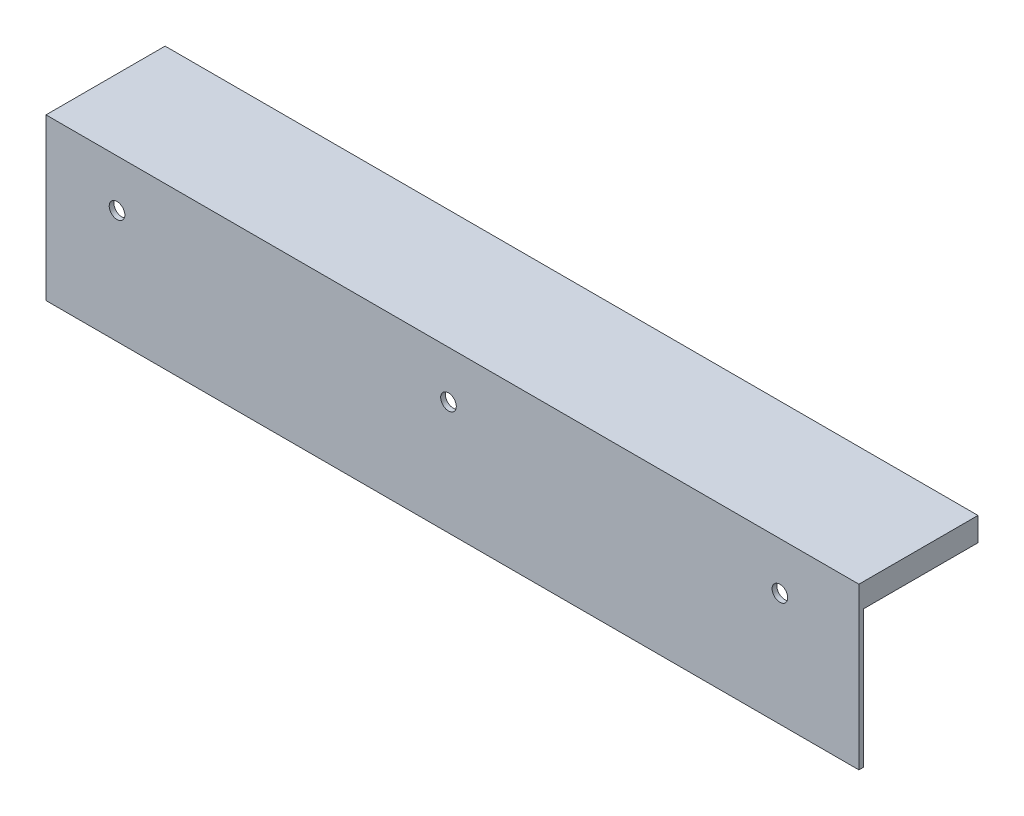
ISO-10303-21;
HEADER;
FILE_DESCRIPTION(('STEP AP214'),'2;1');
FILE_NAME('part.step','',(''),(''),'','','');
FILE_SCHEMA(('AUTOMOTIVE_DESIGN { 1 0 10303 214 1 1 1 1 }'));
ENDSEC;
DATA;
#1=APPLICATION_CONTEXT('core data for automotive mechanical design processes');
#2=APPLICATION_PROTOCOL_DEFINITION('international standard','automotive_design',2000,#1);
#3=PRODUCT_CONTEXT('',#1,'mechanical');
#4=PRODUCT('Part','Part','',(#3));
#5=PRODUCT_RELATED_PRODUCT_CATEGORY('part','',(#4));
#6=PRODUCT_DEFINITION_FORMATION('','',#4);
#7=PRODUCT_DEFINITION_CONTEXT('part definition',#1,'design');
#8=PRODUCT_DEFINITION('design','',#6,#7);
#9=PRODUCT_DEFINITION_SHAPE('','',#8);
#10=(LENGTH_UNIT() NAMED_UNIT(*) SI_UNIT(.MILLI.,.METRE.));
#11=(NAMED_UNIT(*) PLANE_ANGLE_UNIT() SI_UNIT($,.RADIAN.));
#12=(NAMED_UNIT(*) SI_UNIT($,.STERADIAN.) SOLID_ANGLE_UNIT());
#13=UNCERTAINTY_MEASURE_WITH_UNIT(LENGTH_MEASURE(1.E-05),#10,'distance_accuracy_value','');
#14=(GEOMETRIC_REPRESENTATION_CONTEXT(3) GLOBAL_UNCERTAINTY_ASSIGNED_CONTEXT((#13)) GLOBAL_UNIT_ASSIGNED_CONTEXT((#10,
#11,#12)) REPRESENTATION_CONTEXT('',''));
#15=CARTESIAN_POINT('',(0.,0.,0.));
#16=DIRECTION('',(0.,0.,1.));
#17=DIRECTION('',(1.,0.,0.));
#18=AXIS2_PLACEMENT_3D('',#15,#16,#17);
#19=CARTESIAN_POINT('',(0.,0.,1.));
#20=DIRECTION('',(0.,0.,1.));
#21=DIRECTION('',(1.,0.,0.));
#22=AXIS2_PLACEMENT_3D('',#19,#20,#21);
#23=PLANE('',#22);
#24=CARTESIAN_POINT('',(-138.1002778115,267.5,1.));
#25=DIRECTION('',(0.,0.,1.));
#26=DIRECTION('',(1.,0.,0.));
#27=AXIS2_PLACEMENT_3D('',#24,#25,#26);
#28=CIRCLE('',#27,1.65000000000002);
#29=CARTESIAN_POINT('',(-136.4502778115,267.5,1.));
#30=VERTEX_POINT('',#29);
#31=EDGE_CURVE('E137',#30,#30,#28,.T.);
#32=ORIENTED_EDGE('',*,*,#31,.F.);
#33=EDGE_LOOP('',(#32));
#34=FACE_BOUND('',#33,.T.);
#35=DIRECTION('',(0.,-1.,0.));
#36=VECTOR('',#35,1.);
#37=CARTESIAN_POINT('',(-223.1002778115,272.5,1.));
#38=LINE('',#37,#36);
#39=CARTESIAN_POINT('',(-223.1002778115,277.5,1.));
#40=VERTEX_POINT('',#39);
#41=CARTESIAN_POINT('',(-223.1002778115,243.530571674649,1.));
#42=VERTEX_POINT('',#41);
#43=EDGE_CURVE('E103',#40,#42,#38,.T.);
#44=ORIENTED_EDGE('',*,*,#43,.T.);
#45=DIRECTION('',(1.,0.,0.));
#46=VECTOR('',#45,1.);
#47=CARTESIAN_POINT('',(-223.1002778115,243.530571674649,1.));
#48=LINE('',#47,#46);
#49=CARTESIAN_POINT('',(-51.419079965,243.530571674649,1.));
#50=VERTEX_POINT('',#49);
#51=EDGE_CURVE('E63',#42,#50,#48,.T.);
#52=ORIENTED_EDGE('',*,*,#51,.T.);
#53=DIRECTION('',(0.,1.,0.));
#54=VECTOR('',#53,1.);
#55=CARTESIAN_POINT('',(-51.419079965,272.5,1.));
#56=LINE('',#55,#54);
#57=CARTESIAN_POINT('',(-51.419079965,277.5,1.));
#58=VERTEX_POINT('',#57);
#59=EDGE_CURVE('E156',#50,#58,#56,.T.);
#60=ORIENTED_EDGE('',*,*,#59,.T.);
#61=DIRECTION('',(1.,0.,0.));
#62=VECTOR('',#61,1.);
#63=CARTESIAN_POINT('',(-223.1002778115,277.5,1.));
#64=LINE('',#63,#62);
#65=EDGE_CURVE('E188',#40,#58,#64,.T.);
#66=ORIENTED_EDGE('',*,*,#65,.F.);
#67=EDGE_LOOP('',(#44,#52,#60,#66));
#68=FACE_BOUND('',#67,.T.);
#69=CARTESIAN_POINT('',(-208.1002778115,267.5,1.));
#70=DIRECTION('',(0.,0.,1.));
#71=DIRECTION('',(1.,0.,0.));
#72=AXIS2_PLACEMENT_3D('',#69,#70,#71);
#73=CIRCLE('',#72,1.65000000000002);
#74=CARTESIAN_POINT('',(-206.4502778115,267.5,1.));
#75=VERTEX_POINT('',#74);
#76=EDGE_CURVE('E145',#75,#75,#73,.T.);
#77=ORIENTED_EDGE('',*,*,#76,.F.);
#78=EDGE_LOOP('',(#77));
#79=FACE_BOUND('',#78,.T.);
#80=CARTESIAN_POINT('',(-68.1002778115,267.5,1.));
#81=DIRECTION('',(0.,0.,1.));
#82=DIRECTION('',(1.,0.,0.));
#83=AXIS2_PLACEMENT_3D('',#80,#81,#82);
#84=CIRCLE('',#83,1.65000000000001);
#85=CARTESIAN_POINT('',(-66.4502778115,267.5,1.));
#86=VERTEX_POINT('',#85);
#87=EDGE_CURVE('E129',#86,#86,#84,.T.);
#88=ORIENTED_EDGE('',*,*,#87,.F.);
#89=EDGE_LOOP('',(#88));
#90=FACE_BOUND('',#89,.T.);
#91=ADVANCED_FACE('F45',(#34,#68,#79,#90),#23,.T.);
#92=CARTESIAN_POINT('',(0.,0.,0.));
#93=DIRECTION('',(0.,0.,1.));
#94=DIRECTION('',(1.,0.,0.));
#95=AXIS2_PLACEMENT_3D('',#92,#93,#94);
#96=PLANE('',#95);
#97=DIRECTION('',(0.,-1.,0.));
#98=VECTOR('',#97,1.);
#99=CARTESIAN_POINT('',(-223.1002778115,272.5,0.));
#100=LINE('',#99,#98);
#101=CARTESIAN_POINT('',(-223.1002778115,272.5,0.));
#102=VERTEX_POINT('',#101);
#103=CARTESIAN_POINT('',(-223.1002778115,243.530571674649,0.));
#104=VERTEX_POINT('',#103);
#105=EDGE_CURVE('E98',#102,#104,#100,.T.);
#106=ORIENTED_EDGE('',*,*,#105,.F.);
#107=DIRECTION('',(-1.,0.,0.));
#108=VECTOR('',#107,1.);
#109=CARTESIAN_POINT('',(-223.1002778115,272.5,0.));
#110=LINE('',#109,#108);
#111=CARTESIAN_POINT('',(-51.419079965,272.5,0.));
#112=VERTEX_POINT('',#111);
#113=EDGE_CURVE('E91',#112,#102,#110,.T.);
#114=ORIENTED_EDGE('',*,*,#113,.F.);
#115=DIRECTION('',(0.,1.,0.));
#116=VECTOR('',#115,1.);
#117=CARTESIAN_POINT('',(-51.419079965,272.5,0.));
#118=LINE('',#117,#116);
#119=CARTESIAN_POINT('',(-51.419079965,243.530571674649,0.));
#120=VERTEX_POINT('',#119);
#121=EDGE_CURVE('E80',#120,#112,#118,.T.);
#122=ORIENTED_EDGE('',*,*,#121,.F.);
#123=DIRECTION('',(1.,0.,0.));
#124=VECTOR('',#123,1.);
#125=CARTESIAN_POINT('',(-223.1002778115,243.530571674649,0.));
#126=LINE('',#125,#124);
#127=EDGE_CURVE('E74',#104,#120,#126,.T.);
#128=ORIENTED_EDGE('',*,*,#127,.F.);
#129=EDGE_LOOP('',(#106,#114,#122,#128));
#130=FACE_BOUND('',#129,.T.);
#131=CARTESIAN_POINT('',(-208.1002778115,267.5,0.));
#132=DIRECTION('',(0.,0.,1.));
#133=DIRECTION('',(1.,0.,0.));
#134=AXIS2_PLACEMENT_3D('',#131,#132,#133);
#135=CIRCLE('',#134,1.65000000000002);
#136=CARTESIAN_POINT('',(-206.4502778115,267.5,0.));
#137=VERTEX_POINT('',#136);
#138=EDGE_CURVE('E141',#137,#137,#135,.T.);
#139=ORIENTED_EDGE('',*,*,#138,.T.);
#140=EDGE_LOOP('',(#139));
#141=FACE_BOUND('',#140,.T.);
#142=CARTESIAN_POINT('',(-138.1002778115,267.5,0.));
#143=DIRECTION('',(0.,0.,1.));
#144=DIRECTION('',(1.,0.,0.));
#145=AXIS2_PLACEMENT_3D('',#142,#143,#144);
#146=CIRCLE('',#145,1.65000000000002);
#147=CARTESIAN_POINT('',(-136.4502778115,267.5,0.));
#148=VERTEX_POINT('',#147);
#149=EDGE_CURVE('E133',#148,#148,#146,.T.);
#150=ORIENTED_EDGE('',*,*,#149,.T.);
#151=EDGE_LOOP('',(#150));
#152=FACE_BOUND('',#151,.T.);
#153=CARTESIAN_POINT('',(-68.1002778115,267.5,0.));
#154=DIRECTION('',(0.,0.,1.));
#155=DIRECTION('',(1.,0.,0.));
#156=AXIS2_PLACEMENT_3D('',#153,#154,#155);
#157=CIRCLE('',#156,1.65000000000001);
#158=CARTESIAN_POINT('',(-66.4502778115,267.5,0.));
#159=VERTEX_POINT('',#158);
#160=EDGE_CURVE('E128',#159,#159,#157,.T.);
#161=ORIENTED_EDGE('',*,*,#160,.T.);
#162=EDGE_LOOP('',(#161));
#163=FACE_BOUND('',#162,.T.);
#164=ADVANCED_FACE('F95',(#130,#141,#152,#163),#96,.F.);
#165=CARTESIAN_POINT('',(-223.1002778115,272.5,1.));
#166=DIRECTION('',(1.,0.,0.));
#167=DIRECTION('',(0.,0.,-1.));
#168=AXIS2_PLACEMENT_3D('',#165,#166,#167);
#169=PLANE('',#168);
#170=ORIENTED_EDGE('',*,*,#105,.T.);
#171=DIRECTION('',(0.,0.,-1.));
#172=VECTOR('',#171,1.);
#173=CARTESIAN_POINT('',(-223.1002778115,243.530571674649,1.));
#174=LINE('',#173,#172);
#175=EDGE_CURVE('E11',#42,#104,#174,.T.);
#176=ORIENTED_EDGE('',*,*,#175,.F.);
#177=ORIENTED_EDGE('',*,*,#43,.F.);
#178=DIRECTION('',(0.,0.,1.));
#179=VECTOR('',#178,1.);
#180=CARTESIAN_POINT('',(-223.1002778115,277.5,1.));
#181=LINE('',#180,#179);
#182=CARTESIAN_POINT('',(-223.1002778115,277.5,-24.1515189829471));
#183=VERTEX_POINT('',#182);
#184=EDGE_CURVE('E115',#183,#40,#181,.T.);
#185=ORIENTED_EDGE('',*,*,#184,.F.);
#186=DIRECTION('',(0.,-1.,0.));
#187=VECTOR('',#186,1.);
#188=CARTESIAN_POINT('',(-223.1002778115,277.5,-24.1515189829471));
#189=LINE('',#188,#187);
#190=CARTESIAN_POINT('',(-223.1002778115,272.5,-24.1515189829471));
#191=VERTEX_POINT('',#190);
#192=EDGE_CURVE('E120',#183,#191,#189,.T.);
#193=ORIENTED_EDGE('',*,*,#192,.T.);
#194=DIRECTION('',(0.,0.,1.));
#195=VECTOR('',#194,1.);
#196=CARTESIAN_POINT('',(-223.1002778115,272.5,1.));
#197=LINE('',#196,#195);
#198=EDGE_CURVE('E110',#191,#102,#197,.T.);
#199=ORIENTED_EDGE('',*,*,#198,.T.);
#200=EDGE_LOOP('',(#170,#176,#177,#185,#193,#199));
#201=FACE_BOUND('',#200,.T.);
#202=ADVANCED_FACE('F47',(#201),#169,.F.);
#203=CARTESIAN_POINT('',(-223.1002778115,243.530571674649,1.));
#204=DIRECTION('',(0.,1.,0.));
#205=DIRECTION('',(0.,0.,1.));
#206=AXIS2_PLACEMENT_3D('',#203,#204,#205);
#207=PLANE('',#206);
#208=ORIENTED_EDGE('',*,*,#127,.T.);
#209=DIRECTION('',(0.,0.,-1.));
#210=VECTOR('',#209,1.);
#211=CARTESIAN_POINT('',(-51.419079965,243.530571674649,1.));
#212=LINE('',#211,#210);
#213=EDGE_CURVE('E55',#50,#120,#212,.T.);
#214=ORIENTED_EDGE('',*,*,#213,.F.);
#215=ORIENTED_EDGE('',*,*,#51,.F.);
#216=ORIENTED_EDGE('',*,*,#175,.T.);
#217=EDGE_LOOP('',(#208,#214,#215,#216));
#218=FACE_BOUND('',#217,.T.);
#219=ADVANCED_FACE('F222',(#218),#207,.F.);
#220=CARTESIAN_POINT('',(-51.419079965,272.5,1.));
#221=DIRECTION('',(-1.,0.,0.));
#222=DIRECTION('',(0.,-1.,0.));
#223=AXIS2_PLACEMENT_3D('',#220,#221,#222);
#224=PLANE('',#223);
#225=ORIENTED_EDGE('',*,*,#121,.T.);
#226=DIRECTION('',(0.,0.,-1.));
#227=VECTOR('',#226,1.);
#228=CARTESIAN_POINT('',(-51.419079965,272.5,1.));
#229=LINE('',#228,#227);
#230=CARTESIAN_POINT('',(-51.419079965,272.5,-24.1515189829471));
#231=VERTEX_POINT('',#230);
#232=EDGE_CURVE('E86',#112,#231,#229,.T.);
#233=ORIENTED_EDGE('',*,*,#232,.T.);
#234=DIRECTION('',(0.,-1.,0.));
#235=VECTOR('',#234,1.);
#236=CARTESIAN_POINT('',(-51.419079965,277.5,-24.1515189829471));
#237=LINE('',#236,#235);
#238=CARTESIAN_POINT('',(-51.419079965,277.5,-24.1515189829471));
#239=VERTEX_POINT('',#238);
#240=EDGE_CURVE('E124',#239,#231,#237,.T.);
#241=ORIENTED_EDGE('',*,*,#240,.F.);
#242=DIRECTION('',(0.,0.,-1.));
#243=VECTOR('',#242,1.);
#244=CARTESIAN_POINT('',(-51.419079965,277.5,1.));
#245=LINE('',#244,#243);
#246=EDGE_CURVE('E184',#58,#239,#245,.T.);
#247=ORIENTED_EDGE('',*,*,#246,.F.);
#248=ORIENTED_EDGE('',*,*,#59,.F.);
#249=ORIENTED_EDGE('',*,*,#213,.T.);
#250=EDGE_LOOP('',(#225,#233,#241,#247,#248,#249));
#251=FACE_BOUND('',#250,.T.);
#252=ADVANCED_FACE('F82',(#251),#224,.F.);
#253=CARTESIAN_POINT('',(-208.1002778115,267.5,1.));
#254=DIRECTION('',(0.,0.,-1.));
#255=DIRECTION('',(-1.,0.,0.));
#256=AXIS2_PLACEMENT_3D('',#253,#254,#255);
#257=CYLINDRICAL_SURFACE('',#256,1.65000000000002);
#258=ORIENTED_EDGE('',*,*,#76,.T.);
#259=EDGE_LOOP('',(#258));
#260=FACE_BOUND('',#259,.T.);
#261=ORIENTED_EDGE('',*,*,#138,.F.);
#262=EDGE_LOOP('',(#261));
#263=FACE_BOUND('',#262,.T.);
#264=ADVANCED_FACE('F228',(#260,#263),#257,.F.);
#265=CARTESIAN_POINT('',(-138.1002778115,267.5,1.));
#266=DIRECTION('',(0.,0.,-1.));
#267=DIRECTION('',(-1.,0.,0.));
#268=AXIS2_PLACEMENT_3D('',#265,#266,#267);
#269=CYLINDRICAL_SURFACE('',#268,1.65000000000002);
#270=ORIENTED_EDGE('',*,*,#31,.T.);
#271=EDGE_LOOP('',(#270));
#272=FACE_BOUND('',#271,.T.);
#273=ORIENTED_EDGE('',*,*,#149,.F.);
#274=EDGE_LOOP('',(#273));
#275=FACE_BOUND('',#274,.T.);
#276=ADVANCED_FACE('F241',(#272,#275),#269,.F.);
#277=CARTESIAN_POINT('',(-68.1002778115,267.5,1.));
#278=DIRECTION('',(0.,0.,-1.));
#279=DIRECTION('',(-1.,0.,0.));
#280=AXIS2_PLACEMENT_3D('',#277,#278,#279);
#281=CYLINDRICAL_SURFACE('',#280,1.65000000000001);
#282=ORIENTED_EDGE('',*,*,#87,.T.);
#283=EDGE_LOOP('',(#282));
#284=FACE_BOUND('',#283,.T.);
#285=ORIENTED_EDGE('',*,*,#160,.F.);
#286=EDGE_LOOP('',(#285));
#287=FACE_BOUND('',#286,.T.);
#288=ADVANCED_FACE('F245',(#284,#287),#281,.F.);
#289=CARTESIAN_POINT('',(-223.1002778115,277.5,-24.1515189829471));
#290=DIRECTION('',(0.,0.,1.));
#291=DIRECTION('',(1.,0.,0.));
#292=AXIS2_PLACEMENT_3D('',#289,#290,#291);
#293=PLANE('',#292);
#294=DIRECTION('',(-1.,0.,0.));
#295=VECTOR('',#294,1.);
#296=CARTESIAN_POINT('',(-223.1002778115,272.5,-24.1515189829471));
#297=LINE('',#296,#295);
#298=EDGE_CURVE('E108',#231,#191,#297,.T.);
#299=ORIENTED_EDGE('',*,*,#298,.T.);
#300=ORIENTED_EDGE('',*,*,#192,.F.);
#301=DIRECTION('',(-1.,0.,0.));
#302=VECTOR('',#301,1.);
#303=CARTESIAN_POINT('',(-223.1002778115,277.5,-24.1515189829471));
#304=LINE('',#303,#302);
#305=EDGE_CURVE('E125',#239,#183,#304,.T.);
#306=ORIENTED_EDGE('',*,*,#305,.F.);
#307=ORIENTED_EDGE('',*,*,#240,.T.);
#308=EDGE_LOOP('',(#299,#300,#306,#307));
#309=FACE_BOUND('',#308,.T.);
#310=ADVANCED_FACE('F220',(#309),#293,.F.);
#311=CARTESIAN_POINT('',(0.,277.5,0.));
#312=DIRECTION('',(0.,-1.,0.));
#313=DIRECTION('',(0.,0.,-1.));
#314=AXIS2_PLACEMENT_3D('',#311,#312,#313);
#315=PLANE('',#314);
#316=ORIENTED_EDGE('',*,*,#184,.T.);
#317=ORIENTED_EDGE('',*,*,#65,.T.);
#318=ORIENTED_EDGE('',*,*,#246,.T.);
#319=ORIENTED_EDGE('',*,*,#305,.T.);
#320=EDGE_LOOP('',(#316,#317,#318,#319));
#321=FACE_BOUND('',#320,.T.);
#322=ADVANCED_FACE('F201',(#321),#315,.F.);
#323=CARTESIAN_POINT('',(0.,272.5,0.));
#324=DIRECTION('',(0.,-1.,0.));
#325=DIRECTION('',(0.,0.,-1.));
#326=AXIS2_PLACEMENT_3D('',#323,#324,#325);
#327=PLANE('',#326);
#328=ORIENTED_EDGE('',*,*,#232,.F.);
#329=ORIENTED_EDGE('',*,*,#113,.T.);
#330=ORIENTED_EDGE('',*,*,#198,.F.);
#331=ORIENTED_EDGE('',*,*,#298,.F.);
#332=EDGE_LOOP('',(#328,#329,#330,#331));
#333=FACE_BOUND('',#332,.T.);
#334=ADVANCED_FACE('F106',(#333),#327,.T.);
#335=CLOSED_SHELL('',(#91,#164,#202,#219,#252,#264,#276,#288,#310,#322,#334));
#336=MANIFOLD_SOLID_BREP('B2',#335);
#337=ADVANCED_BREP_SHAPE_REPRESENTATION('',(#18,#336),#14);
#338=SHAPE_DEFINITION_REPRESENTATION(#9,#337);
ENDSEC;
END-ISO-10303-21;
